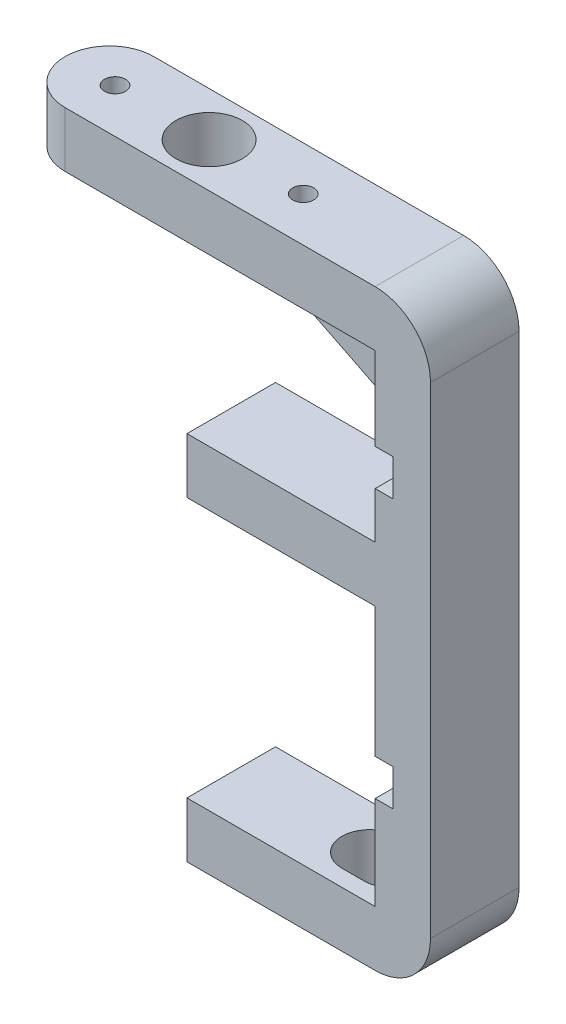
ISO-10303-21;
HEADER;
FILE_DESCRIPTION(('STEP AP214'),'2;1');
FILE_NAME('part.step','',(''),(''),'','','');
FILE_SCHEMA(('AUTOMOTIVE_DESIGN { 1 0 10303 214 1 1 1 1 }'));
ENDSEC;
DATA;
#1=APPLICATION_CONTEXT('core data for automotive mechanical design processes');
#2=APPLICATION_PROTOCOL_DEFINITION('international standard','automotive_design',2000,#1);
#3=PRODUCT_CONTEXT('',#1,'mechanical');
#4=PRODUCT('Part','Part','',(#3));
#5=PRODUCT_RELATED_PRODUCT_CATEGORY('part','',(#4));
#6=PRODUCT_DEFINITION_FORMATION('','',#4);
#7=PRODUCT_DEFINITION_CONTEXT('part definition',#1,'design');
#8=PRODUCT_DEFINITION('design','',#6,#7);
#9=PRODUCT_DEFINITION_SHAPE('','',#8);
#10=(LENGTH_UNIT() NAMED_UNIT(*) SI_UNIT(.MILLI.,.METRE.));
#11=(NAMED_UNIT(*) PLANE_ANGLE_UNIT() SI_UNIT($,.RADIAN.));
#12=(NAMED_UNIT(*) SI_UNIT($,.STERADIAN.) SOLID_ANGLE_UNIT());
#13=UNCERTAINTY_MEASURE_WITH_UNIT(LENGTH_MEASURE(1.E-05),#10,'distance_accuracy_value','');
#14=(GEOMETRIC_REPRESENTATION_CONTEXT(3) GLOBAL_UNCERTAINTY_ASSIGNED_CONTEXT((#13)) GLOBAL_UNIT_ASSIGNED_CONTEXT((#10,
#11,#12)) REPRESENTATION_CONTEXT('',''));
#15=CARTESIAN_POINT('',(0.,0.,0.));
#16=DIRECTION('',(0.,0.,1.));
#17=DIRECTION('',(1.,0.,0.));
#18=AXIS2_PLACEMENT_3D('',#15,#16,#17);
#19=CARTESIAN_POINT('',(17.,0.,4.));
#20=DIRECTION('',(1.,0.,0.));
#21=DIRECTION('',(0.,0.,-1.));
#22=AXIS2_PLACEMENT_3D('',#19,#20,#21);
#23=PLANE('',#22);
#24=DIRECTION('',(0.,-1.,0.));
#25=VECTOR('',#24,1.);
#26=CARTESIAN_POINT('',(17.,0.,-4.));
#27=LINE('',#26,#25);
#28=CARTESIAN_POINT('',(17.,23.5,-4.));
#29=VERTEX_POINT('',#28);
#30=CARTESIAN_POINT('',(17.,11.75,-4.));
#31=VERTEX_POINT('',#30);
#32=EDGE_CURVE('E561',#29,#31,#27,.T.);
#33=ORIENTED_EDGE('',*,*,#32,.T.);
#34=DIRECTION('',(0.,0.,1.));
#35=VECTOR('',#34,1.);
#36=CARTESIAN_POINT('',(17.,11.75,-6.));
#37=LINE('',#36,#35);
#38=CARTESIAN_POINT('',(17.,11.75,4.));
#39=VERTEX_POINT('',#38);
#40=EDGE_CURVE('E335',#31,#39,#37,.T.);
#41=ORIENTED_EDGE('',*,*,#40,.T.);
#42=DIRECTION('',(0.,-1.,0.));
#43=VECTOR('',#42,1.);
#44=CARTESIAN_POINT('',(17.,0.,4.));
#45=LINE('',#44,#43);
#46=CARTESIAN_POINT('',(17.,23.5,4.));
#47=VERTEX_POINT('',#46);
#48=EDGE_CURVE('E269',#47,#39,#45,.T.);
#49=ORIENTED_EDGE('',*,*,#48,.F.);
#50=DIRECTION('',(0.,0.,-1.));
#51=VECTOR('',#50,1.);
#52=CARTESIAN_POINT('',(17.,23.5,4.));
#53=LINE('',#52,#51);
#54=EDGE_CURVE('E324',#47,#29,#53,.T.);
#55=ORIENTED_EDGE('',*,*,#54,.T.);
#56=EDGE_LOOP('',(#33,#41,#49,#55));
#57=FACE_BOUND('',#56,.T.);
#58=ADVANCED_FACE('F37',(#57),#23,.F.);
#59=CARTESIAN_POINT('',(17.,48.5,-4.));
#60=DIRECTION('',(1.,0.,0.));
#61=DIRECTION('',(0.,1.,0.));
#62=AXIS2_PLACEMENT_3D('',#59,#60,#61);
#63=PLANE('',#62);
#64=DIRECTION('',(0.,-1.,0.));
#65=VECTOR('',#64,1.);
#66=CARTESIAN_POINT('',(17.,48.5,-4.));
#67=LINE('',#66,#65);
#68=CARTESIAN_POINT('',(17.,43.5,-4.));
#69=VERTEX_POINT('',#68);
#70=CARTESIAN_POINT('',(17.,36.,-4.));
#71=VERTEX_POINT('',#70);
#72=EDGE_CURVE('E283',#69,#71,#67,.T.);
#73=ORIENTED_EDGE('',*,*,#72,.T.);
#74=DIRECTION('',(0.,0.,1.));
#75=VECTOR('',#74,1.);
#76=CARTESIAN_POINT('',(17.,36.,-6.));
#77=LINE('',#76,#75);
#78=CARTESIAN_POINT('',(17.,36.,4.));
#79=VERTEX_POINT('',#78);
#80=EDGE_CURVE('E352',#71,#79,#77,.T.);
#81=ORIENTED_EDGE('',*,*,#80,.T.);
#82=DIRECTION('',(0.,-1.,0.));
#83=VECTOR('',#82,1.);
#84=CARTESIAN_POINT('',(17.,48.5,4.));
#85=LINE('',#84,#83);
#86=CARTESIAN_POINT('',(17.,43.5,4.));
#87=VERTEX_POINT('',#86);
#88=EDGE_CURVE('E513',#87,#79,#85,.T.);
#89=ORIENTED_EDGE('',*,*,#88,.F.);
#90=DIRECTION('',(0.,0.,1.));
#91=VECTOR('',#90,1.);
#92=CARTESIAN_POINT('',(17.,43.5,4.));
#93=LINE('',#92,#91);
#94=CARTESIAN_POINT('',(17.,43.5,2.5));
#95=VERTEX_POINT('',#94);
#96=EDGE_CURVE('E443',#95,#87,#93,.T.);
#97=ORIENTED_EDGE('',*,*,#96,.F.);
#98=DIRECTION('',(0.,1.,0.));
#99=VECTOR('',#98,1.);
#100=CARTESIAN_POINT('',(17.,38.5,2.5));
#101=LINE('',#100,#99);
#102=CARTESIAN_POINT('',(17.,38.5,2.5));
#103=VERTEX_POINT('',#102);
#104=EDGE_CURVE('E419',#103,#95,#101,.T.);
#105=ORIENTED_EDGE('',*,*,#104,.F.);
#106=DIRECTION('',(0.,0.,-1.));
#107=VECTOR('',#106,1.);
#108=CARTESIAN_POINT('',(17.,38.5,2.5));
#109=LINE('',#108,#107);
#110=CARTESIAN_POINT('',(17.,38.5,-2.5));
#111=VERTEX_POINT('',#110);
#112=EDGE_CURVE('E429',#103,#111,#109,.T.);
#113=ORIENTED_EDGE('',*,*,#112,.T.);
#114=DIRECTION('',(0.,1.,0.));
#115=VECTOR('',#114,1.);
#116=CARTESIAN_POINT('',(17.,38.5,-2.5));
#117=LINE('',#116,#115);
#118=CARTESIAN_POINT('',(17.,43.5,-2.5));
#119=VERTEX_POINT('',#118);
#120=EDGE_CURVE('E430',#111,#119,#117,.T.);
#121=ORIENTED_EDGE('',*,*,#120,.T.);
#122=EDGE_CURVE('E444',#69,#119,#93,.T.);
#123=ORIENTED_EDGE('',*,*,#122,.F.);
#124=EDGE_LOOP('',(#73,#81,#89,#97,#105,#113,#121,#123));
#125=FACE_BOUND('',#124,.T.);
#126=ADVANCED_FACE('F592',(#125),#63,.F.);
#127=CARTESIAN_POINT('',(17.,32.7,4.));
#128=VERTEX_POINT('',#127);
#129=CARTESIAN_POINT('',(17.,28.5,4.));
#130=VERTEX_POINT('',#129);
#131=EDGE_CURVE('E454',#128,#130,#85,.T.);
#132=ORIENTED_EDGE('',*,*,#131,.F.);
#133=DIRECTION('',(0.,0.,1.));
#134=VECTOR('',#133,1.);
#135=CARTESIAN_POINT('',(17.,32.7,-6.));
#136=LINE('',#135,#134);
#137=CARTESIAN_POINT('',(17.,32.7,-4.));
#138=VERTEX_POINT('',#137);
#139=EDGE_CURVE('E351',#138,#128,#136,.T.);
#140=ORIENTED_EDGE('',*,*,#139,.F.);
#141=CARTESIAN_POINT('',(17.,28.5,-4.));
#142=VERTEX_POINT('',#141);
#143=EDGE_CURVE('E510',#138,#142,#67,.T.);
#144=ORIENTED_EDGE('',*,*,#143,.T.);
#145=DIRECTION('',(0.,0.,1.));
#146=VECTOR('',#145,1.);
#147=CARTESIAN_POINT('',(17.,28.5,-4.));
#148=LINE('',#147,#146);
#149=EDGE_CURVE('E303',#142,#130,#148,.T.);
#150=ORIENTED_EDGE('',*,*,#149,.T.);
#151=EDGE_LOOP('',(#132,#140,#144,#150));
#152=FACE_BOUND('',#151,.T.);
#153=ADVANCED_FACE('F597',(#152),#63,.F.);
#154=CARTESIAN_POINT('',(0.,28.5,4.));
#155=DIRECTION('',(0.,-1.,0.));
#156=DIRECTION('',(0.,0.,-1.));
#157=AXIS2_PLACEMENT_3D('',#154,#155,#156);
#158=PLANE('',#157);
#159=ORIENTED_EDGE('',*,*,#149,.F.);
#160=DIRECTION('',(-1.,0.,0.));
#161=VECTOR('',#160,1.);
#162=CARTESIAN_POINT('',(0.,28.5,-4.));
#163=LINE('',#162,#161);
#164=CARTESIAN_POINT('',(0.,28.5,-4.));
#165=VERTEX_POINT('',#164);
#166=EDGE_CURVE('E289',#142,#165,#163,.T.);
#167=ORIENTED_EDGE('',*,*,#166,.T.);
#168=DIRECTION('',(0.,0.,-1.));
#169=VECTOR('',#168,1.);
#170=CARTESIAN_POINT('',(0.,28.5,4.));
#171=LINE('',#170,#169);
#172=CARTESIAN_POINT('',(0.,28.5,4.));
#173=VERTEX_POINT('',#172);
#174=EDGE_CURVE('E323',#173,#165,#171,.T.);
#175=ORIENTED_EDGE('',*,*,#174,.F.);
#176=DIRECTION('',(-1.,0.,0.));
#177=VECTOR('',#176,1.);
#178=CARTESIAN_POINT('',(0.,28.5,4.));
#179=LINE('',#178,#177);
#180=EDGE_CURVE('E299',#130,#173,#179,.T.);
#181=ORIENTED_EDGE('',*,*,#180,.F.);
#182=EDGE_LOOP('',(#159,#167,#175,#181));
#183=FACE_BOUND('',#182,.T.);
#184=ADVANCED_FACE('F614',(#183),#158,.F.);
#185=CARTESIAN_POINT('',(0.,-5.,4.));
#186=DIRECTION('',(1.,0.,0.));
#187=DIRECTION('',(0.,0.,-1.));
#188=AXIS2_PLACEMENT_3D('',#185,#186,#187);
#189=PLANE('',#188);
#190=CARTESIAN_POINT('',(0.,-1.89378755196279,-5.85583143929343E-05));
#191=DIRECTION('',(-1.,0.,0.));
#192=DIRECTION('',(0.,0.,1.));
#193=AXIS2_PLACEMENT_3D('',#190,#191,#192);
#194=CIRCLE('',#193,1.2);
#195=CARTESIAN_POINT('',(0.,-1.89378755196279,1.19994144168561));
#196=VERTEX_POINT('',#195);
#197=EDGE_CURVE('E406',#196,#196,#194,.T.);
#198=ORIENTED_EDGE('',*,*,#197,.F.);
#199=EDGE_LOOP('',(#198));
#200=FACE_BOUND('',#199,.T.);
#201=DIRECTION('',(0.,-1.,0.));
#202=VECTOR('',#201,1.);
#203=CARTESIAN_POINT('',(0.,-5.,-4.));
#204=LINE('',#203,#202);
#205=CARTESIAN_POINT('',(0.,0.,-4.));
#206=VERTEX_POINT('',#205);
#207=CARTESIAN_POINT('',(0.,-5.,-4.));
#208=VERTEX_POINT('',#207);
#209=EDGE_CURVE('E279',#206,#208,#204,.T.);
#210=ORIENTED_EDGE('',*,*,#209,.T.);
#211=DIRECTION('',(0.,0.,-1.));
#212=VECTOR('',#211,1.);
#213=CARTESIAN_POINT('',(0.,-5.,4.));
#214=LINE('',#213,#212);
#215=CARTESIAN_POINT('',(0.,-5.,4.));
#216=VERTEX_POINT('',#215);
#217=EDGE_CURVE('E297',#216,#208,#214,.T.);
#218=ORIENTED_EDGE('',*,*,#217,.F.);
#219=DIRECTION('',(0.,-1.,0.));
#220=VECTOR('',#219,1.);
#221=CARTESIAN_POINT('',(0.,-5.,4.));
#222=LINE('',#221,#220);
#223=CARTESIAN_POINT('',(0.,0.,4.));
#224=VERTEX_POINT('',#223);
#225=EDGE_CURVE('E457',#224,#216,#222,.T.);
#226=ORIENTED_EDGE('',*,*,#225,.F.);
#227=DIRECTION('',(0.,0.,-1.));
#228=VECTOR('',#227,1.);
#229=CARTESIAN_POINT('',(0.,0.,4.));
#230=LINE('',#229,#228);
#231=EDGE_CURVE('E278',#224,#206,#230,.T.);
#232=ORIENTED_EDGE('',*,*,#231,.T.);
#233=EDGE_LOOP('',(#210,#218,#226,#232));
#234=FACE_BOUND('',#233,.T.);
#235=ADVANCED_FACE('F547',(#200,#234),#189,.F.);
#236=CARTESIAN_POINT('',(22.,-5.,4.));
#237=DIRECTION('',(0.,1.,0.));
#238=DIRECTION('',(-1.,0.,0.));
#239=AXIS2_PLACEMENT_3D('',#236,#237,#238);
#240=PLANE('',#239);
#241=CARTESIAN_POINT('',(14.5,-5.,0.));
#242=DIRECTION('',(0.,1.,0.));
#243=DIRECTION('',(-1.,0.,0.));
#244=AXIS2_PLACEMENT_3D('',#241,#242,#243);
#245=CIRCLE('',#244,2.5);
#246=CARTESIAN_POINT('',(17.,-5.,0.));
#247=VERTEX_POINT('',#246);
#248=CARTESIAN_POINT('',(14.5,-5.,-2.5));
#249=VERTEX_POINT('',#248);
#250=EDGE_CURVE('E373',#247,#249,#245,.T.);
#251=ORIENTED_EDGE('',*,*,#250,.T.);
#252=DIRECTION('',(-1.,0.,0.));
#253=VECTOR('',#252,1.);
#254=CARTESIAN_POINT('',(22.,-5.,-2.5));
#255=LINE('',#254,#253);
#256=CARTESIAN_POINT('',(12.5,-5.,-2.5));
#257=VERTEX_POINT('',#256);
#258=EDGE_CURVE('E386',#249,#257,#255,.T.);
#259=ORIENTED_EDGE('',*,*,#258,.T.);
#260=CARTESIAN_POINT('',(12.5,-5.,0.));
#261=DIRECTION('',(0.,1.,0.));
#262=DIRECTION('',(-1.,0.,0.));
#263=AXIS2_PLACEMENT_3D('',#260,#261,#262);
#264=CIRCLE('',#263,2.5);
#265=CARTESIAN_POINT('',(12.5,-5.,2.5));
#266=VERTEX_POINT('',#265);
#267=EDGE_CURVE('E389',#257,#266,#264,.T.);
#268=ORIENTED_EDGE('',*,*,#267,.T.);
#269=DIRECTION('',(1.,0.,0.));
#270=VECTOR('',#269,1.);
#271=CARTESIAN_POINT('',(22.,-5.,2.5));
#272=LINE('',#271,#270);
#273=CARTESIAN_POINT('',(14.5,-5.,2.5));
#274=VERTEX_POINT('',#273);
#275=EDGE_CURVE('E383',#266,#274,#272,.T.);
#276=ORIENTED_EDGE('',*,*,#275,.T.);
#277=EDGE_CURVE('E382',#274,#247,#245,.T.);
#278=ORIENTED_EDGE('',*,*,#277,.T.);
#279=DIRECTION('',(0.,0.,-1.));
#280=VECTOR('',#279,1.);
#281=CARTESIAN_POINT('',(17.,-5.,4.));
#282=LINE('',#281,#280);
#283=CARTESIAN_POINT('',(17.,-5.,4.));
#284=VERTEX_POINT('',#283);
#285=EDGE_CURVE('E484',#247,#284,#282,.F.);
#286=ORIENTED_EDGE('',*,*,#285,.T.);
#287=DIRECTION('',(1.,0.,0.));
#288=VECTOR('',#287,1.);
#289=CARTESIAN_POINT('',(22.,-5.,4.));
#290=LINE('',#289,#288);
#291=EDGE_CURVE('E459',#216,#284,#290,.T.);
#292=ORIENTED_EDGE('',*,*,#291,.F.);
#293=ORIENTED_EDGE('',*,*,#217,.T.);
#294=DIRECTION('',(1.,0.,0.));
#295=VECTOR('',#294,1.);
#296=CARTESIAN_POINT('',(22.,-5.,-4.));
#297=LINE('',#296,#295);
#298=CARTESIAN_POINT('',(17.,-5.,-4.));
#299=VERTEX_POINT('',#298);
#300=EDGE_CURVE('E282',#208,#299,#297,.T.);
#301=ORIENTED_EDGE('',*,*,#300,.T.);
#302=EDGE_CURVE('E480',#299,#247,#282,.F.);
#303=ORIENTED_EDGE('',*,*,#302,.T.);
#304=EDGE_LOOP('',(#251,#259,#268,#276,#278,#286,#292,#293,#301,#303));
#305=FACE_BOUND('',#304,.T.);
#306=ADVANCED_FACE('F534',(#305),#240,.F.);
#307=CARTESIAN_POINT('',(22.,28.5,4.));
#308=DIRECTION('',(-1.,0.,0.));
#309=DIRECTION('',(0.,-1.,0.));
#310=AXIS2_PLACEMENT_3D('',#307,#308,#309);
#311=PLANE('',#310);
#312=DIRECTION('',(0.,1.,0.));
#313=VECTOR('',#312,1.);
#314=CARTESIAN_POINT('',(22.,28.5,4.));
#315=LINE('',#314,#313);
#316=CARTESIAN_POINT('',(22.,0.,4.));
#317=VERTEX_POINT('',#316);
#318=CARTESIAN_POINT('',(22.,43.5,4.));
#319=VERTEX_POINT('',#318);
#320=EDGE_CURVE('E302',#317,#319,#315,.T.);
#321=ORIENTED_EDGE('',*,*,#320,.F.);
#322=DIRECTION('',(0.,0.,-1.));
#323=VECTOR('',#322,1.);
#324=CARTESIAN_POINT('',(22.,0.,4.));
#325=LINE('',#324,#323);
#326=CARTESIAN_POINT('',(22.,0.,-4.));
#327=VERTEX_POINT('',#326);
#328=EDGE_CURVE('E525',#317,#327,#325,.T.);
#329=ORIENTED_EDGE('',*,*,#328,.T.);
#330=DIRECTION('',(0.,1.,0.));
#331=VECTOR('',#330,1.);
#332=CARTESIAN_POINT('',(22.,28.5,-4.));
#333=LINE('',#332,#331);
#334=CARTESIAN_POINT('',(22.,43.5,-4.));
#335=VERTEX_POINT('',#334);
#336=EDGE_CURVE('E286',#327,#335,#333,.T.);
#337=ORIENTED_EDGE('',*,*,#336,.T.);
#338=DIRECTION('',(0.,0.,-1.));
#339=VECTOR('',#338,1.);
#340=CARTESIAN_POINT('',(22.,43.5,4.));
#341=LINE('',#340,#339);
#342=EDGE_CURVE('E477',#335,#319,#341,.F.);
#343=ORIENTED_EDGE('',*,*,#342,.T.);
#344=EDGE_LOOP('',(#321,#329,#337,#343));
#345=FACE_BOUND('',#344,.T.);
#346=ADVANCED_FACE('F610',(#345),#311,.F.);
#347=CARTESIAN_POINT('',(0.,23.5,4.));
#348=DIRECTION('',(1.,0.,0.));
#349=DIRECTION('',(0.,0.,-1.));
#350=AXIS2_PLACEMENT_3D('',#347,#348,#349);
#351=PLANE('',#350);
#352=CARTESIAN_POINT('',(0.,25.0936865803843,-6.14151502839416E-05));
#353=DIRECTION('',(-1.,0.,0.));
#354=DIRECTION('',(0.,0.,1.));
#355=AXIS2_PLACEMENT_3D('',#352,#353,#354);
#356=CIRCLE('',#355,1.2);
#357=CARTESIAN_POINT('',(0.,25.0936865803843,1.19993858484972));
#358=VERTEX_POINT('',#357);
#359=EDGE_CURVE('E405',#358,#358,#356,.T.);
#360=ORIENTED_EDGE('',*,*,#359,.F.);
#361=EDGE_LOOP('',(#360));
#362=FACE_BOUND('',#361,.T.);
#363=DIRECTION('',(0.,-1.,0.));
#364=VECTOR('',#363,1.);
#365=CARTESIAN_POINT('',(0.,23.5,-4.));
#366=LINE('',#365,#364);
#367=CARTESIAN_POINT('',(0.,23.5,-4.));
#368=VERTEX_POINT('',#367);
#369=EDGE_CURVE('E292',#165,#368,#366,.T.);
#370=ORIENTED_EDGE('',*,*,#369,.T.);
#371=DIRECTION('',(0.,0.,-1.));
#372=VECTOR('',#371,1.);
#373=CARTESIAN_POINT('',(0.,23.5,4.));
#374=LINE('',#373,#372);
#375=CARTESIAN_POINT('',(0.,23.5,4.));
#376=VERTEX_POINT('',#375);
#377=EDGE_CURVE('E318',#376,#368,#374,.T.);
#378=ORIENTED_EDGE('',*,*,#377,.F.);
#379=DIRECTION('',(0.,-1.,0.));
#380=VECTOR('',#379,1.);
#381=CARTESIAN_POINT('',(0.,23.5,4.));
#382=LINE('',#381,#380);
#383=EDGE_CURVE('E273',#173,#376,#382,.T.);
#384=ORIENTED_EDGE('',*,*,#383,.F.);
#385=ORIENTED_EDGE('',*,*,#174,.T.);
#386=EDGE_LOOP('',(#370,#378,#384,#385));
#387=FACE_BOUND('',#386,.T.);
#388=ADVANCED_FACE('F319',(#362,#387),#351,.F.);
#389=CARTESIAN_POINT('',(17.,23.5,4.));
#390=DIRECTION('',(0.,1.,0.));
#391=DIRECTION('',(-1.,0.,0.));
#392=AXIS2_PLACEMENT_3D('',#389,#390,#391);
#393=PLANE('',#392);
#394=DIRECTION('',(1.,0.,0.));
#395=VECTOR('',#394,1.);
#396=CARTESIAN_POINT('',(17.,23.5,-4.));
#397=LINE('',#396,#395);
#398=EDGE_CURVE('E329',#368,#29,#397,.T.);
#399=ORIENTED_EDGE('',*,*,#398,.T.);
#400=ORIENTED_EDGE('',*,*,#54,.F.);
#401=DIRECTION('',(1.,0.,0.));
#402=VECTOR('',#401,1.);
#403=CARTESIAN_POINT('',(17.,23.5,4.));
#404=LINE('',#403,#402);
#405=EDGE_CURVE('E270',#376,#47,#404,.T.);
#406=ORIENTED_EDGE('',*,*,#405,.F.);
#407=ORIENTED_EDGE('',*,*,#377,.T.);
#408=EDGE_LOOP('',(#399,#400,#406,#407));
#409=FACE_BOUND('',#408,.T.);
#410=ADVANCED_FACE('F326',(#409),#393,.F.);
#411=CARTESIAN_POINT('',(17.,8.45,4.));
#412=VERTEX_POINT('',#411);
#413=CARTESIAN_POINT('',(17.,0.,4.));
#414=VERTEX_POINT('',#413);
#415=EDGE_CURVE('E258',#412,#414,#45,.T.);
#416=ORIENTED_EDGE('',*,*,#415,.F.);
#417=DIRECTION('',(0.,0.,1.));
#418=VECTOR('',#417,1.);
#419=CARTESIAN_POINT('',(17.,8.45,-6.));
#420=LINE('',#419,#418);
#421=CARTESIAN_POINT('',(17.,8.45,-4.));
#422=VERTEX_POINT('',#421);
#423=EDGE_CURVE('E243',#422,#412,#420,.T.);
#424=ORIENTED_EDGE('',*,*,#423,.F.);
#425=CARTESIAN_POINT('',(17.,0.,-4.));
#426=VERTEX_POINT('',#425);
#427=EDGE_CURVE('E560',#422,#426,#27,.T.);
#428=ORIENTED_EDGE('',*,*,#427,.T.);
#429=DIRECTION('',(0.,0.,-1.));
#430=VECTOR('',#429,1.);
#431=CARTESIAN_POINT('',(17.,0.,4.));
#432=LINE('',#431,#430);
#433=CARTESIAN_POINT('',(17.,0.,0.));
#434=VERTEX_POINT('',#433);
#435=EDGE_CURVE('E551',#434,#426,#432,.T.);
#436=ORIENTED_EDGE('',*,*,#435,.F.);
#437=EDGE_CURVE('E267',#414,#434,#432,.T.);
#438=ORIENTED_EDGE('',*,*,#437,.F.);
#439=EDGE_LOOP('',(#416,#424,#428,#436,#438));
#440=FACE_BOUND('',#439,.T.);
#441=ADVANCED_FACE('F264',(#440),#23,.F.);
#442=CARTESIAN_POINT('',(0.,0.,4.));
#443=DIRECTION('',(0.,-1.,0.));
#444=DIRECTION('',(0.,0.,-1.));
#445=AXIS2_PLACEMENT_3D('',#442,#443,#444);
#446=PLANE('',#445);
#447=DIRECTION('',(1.,0.,0.));
#448=VECTOR('',#447,1.);
#449=CARTESIAN_POINT('',(12.5,0.,2.5));
#450=LINE('',#449,#448);
#451=CARTESIAN_POINT('',(12.5,0.,2.5));
#452=VERTEX_POINT('',#451);
#453=CARTESIAN_POINT('',(14.5,0.,2.5));
#454=VERTEX_POINT('',#453);
#455=EDGE_CURVE('E361',#452,#454,#450,.T.);
#456=ORIENTED_EDGE('',*,*,#455,.F.);
#457=CARTESIAN_POINT('',(12.5,0.,0.));
#458=DIRECTION('',(0.,1.,0.));
#459=DIRECTION('',(0.,0.,1.));
#460=AXIS2_PLACEMENT_3D('',#457,#458,#459);
#461=CIRCLE('',#460,2.5);
#462=CARTESIAN_POINT('',(12.5,0.,-2.5));
#463=VERTEX_POINT('',#462);
#464=EDGE_CURVE('E355',#463,#452,#461,.T.);
#465=ORIENTED_EDGE('',*,*,#464,.F.);
#466=DIRECTION('',(-1.,0.,0.));
#467=VECTOR('',#466,1.);
#468=CARTESIAN_POINT('',(12.5,0.,-2.5));
#469=LINE('',#468,#467);
#470=CARTESIAN_POINT('',(14.5,0.,-2.5));
#471=VERTEX_POINT('',#470);
#472=EDGE_CURVE('E367',#471,#463,#469,.T.);
#473=ORIENTED_EDGE('',*,*,#472,.F.);
#474=CARTESIAN_POINT('',(14.5,0.,0.));
#475=DIRECTION('',(0.,1.,0.));
#476=DIRECTION('',(0.,0.,1.));
#477=AXIS2_PLACEMENT_3D('',#474,#475,#476);
#478=CIRCLE('',#477,2.5);
#479=EDGE_CURVE('E364',#434,#471,#478,.T.);
#480=ORIENTED_EDGE('',*,*,#479,.F.);
#481=ORIENTED_EDGE('',*,*,#435,.T.);
#482=DIRECTION('',(-1.,0.,0.));
#483=VECTOR('',#482,1.);
#484=CARTESIAN_POINT('',(0.,0.,-4.));
#485=LINE('',#484,#483);
#486=EDGE_CURVE('E460',#426,#206,#485,.T.);
#487=ORIENTED_EDGE('',*,*,#486,.T.);
#488=ORIENTED_EDGE('',*,*,#231,.F.);
#489=DIRECTION('',(-1.,0.,0.));
#490=VECTOR('',#489,1.);
#491=CARTESIAN_POINT('',(0.,0.,4.));
#492=LINE('',#491,#490);
#493=EDGE_CURVE('E272',#414,#224,#492,.T.);
#494=ORIENTED_EDGE('',*,*,#493,.F.);
#495=ORIENTED_EDGE('',*,*,#437,.T.);
#496=EDGE_CURVE('E365',#454,#434,#478,.T.);
#497=ORIENTED_EDGE('',*,*,#496,.F.);
#498=EDGE_LOOP('',(#456,#465,#473,#480,#481,#487,#488,#494,#495,#497));
#499=FACE_BOUND('',#498,.T.);
#500=ADVANCED_FACE('F563',(#499),#446,.F.);
#501=CARTESIAN_POINT('',(0.,0.,4.));
#502=DIRECTION('',(0.,0.,-1.));
#503=DIRECTION('',(-1.,0.,0.));
#504=AXIS2_PLACEMENT_3D('',#501,#502,#503);
#505=PLANE('',#504);
#506=ORIENTED_EDGE('',*,*,#48,.T.);
#507=DIRECTION('',(-1.,0.,0.));
#508=VECTOR('',#507,1.);
#509=CARTESIAN_POINT('',(17.,11.75,4.));
#510=LINE('',#509,#508);
#511=CARTESIAN_POINT('',(18.6,11.75,4.));
#512=VERTEX_POINT('',#511);
#513=EDGE_CURVE('E253',#512,#39,#510,.T.);
#514=ORIENTED_EDGE('',*,*,#513,.F.);
#515=DIRECTION('',(0.,1.,0.));
#516=VECTOR('',#515,1.);
#517=CARTESIAN_POINT('',(18.6,11.75,4.));
#518=LINE('',#517,#516);
#519=CARTESIAN_POINT('',(18.6,8.45,4.));
#520=VERTEX_POINT('',#519);
#521=EDGE_CURVE('E262',#520,#512,#518,.T.);
#522=ORIENTED_EDGE('',*,*,#521,.F.);
#523=DIRECTION('',(1.,0.,0.));
#524=VECTOR('',#523,1.);
#525=CARTESIAN_POINT('',(17.,8.45,4.));
#526=LINE('',#525,#524);
#527=EDGE_CURVE('E246',#412,#520,#526,.T.);
#528=ORIENTED_EDGE('',*,*,#527,.F.);
#529=ORIENTED_EDGE('',*,*,#415,.T.);
#530=ORIENTED_EDGE('',*,*,#493,.T.);
#531=ORIENTED_EDGE('',*,*,#225,.T.);
#532=ORIENTED_EDGE('',*,*,#291,.T.);
#533=CARTESIAN_POINT('',(17.,0.,4.));
#534=DIRECTION('',(0.,0.,-1.));
#535=DIRECTION('',(-1.,0.,0.));
#536=AXIS2_PLACEMENT_3D('',#533,#534,#535);
#537=CIRCLE('',#536,5.);
#538=EDGE_CURVE('E470',#284,#317,#537,.F.);
#539=ORIENTED_EDGE('',*,*,#538,.T.);
#540=ORIENTED_EDGE('',*,*,#320,.T.);
#541=CARTESIAN_POINT('',(17.,43.5,4.));
#542=DIRECTION('',(0.,0.,-1.));
#543=DIRECTION('',(-1.,0.,0.));
#544=AXIS2_PLACEMENT_3D('',#541,#542,#543);
#545=CIRCLE('',#544,5.);
#546=CARTESIAN_POINT('',(17.,48.5,4.));
#547=VERTEX_POINT('',#546);
#548=EDGE_CURVE('E468',#319,#547,#545,.F.);
#549=ORIENTED_EDGE('',*,*,#548,.T.);
#550=DIRECTION('',(1.,0.,0.));
#551=VECTOR('',#550,1.);
#552=CARTESIAN_POINT('',(22.,48.5,4.));
#553=LINE('',#552,#551);
#554=CARTESIAN_POINT('',(-11.,48.5,4.));
#555=VERTEX_POINT('',#554);
#556=EDGE_CURVE('E453',#555,#547,#553,.T.);
#557=ORIENTED_EDGE('',*,*,#556,.F.);
#558=DIRECTION('',(0.,1.,0.));
#559=VECTOR('',#558,1.);
#560=CARTESIAN_POINT('',(-11.,0.,4.));
#561=LINE('',#560,#559);
#562=CARTESIAN_POINT('',(-11.,43.5,4.));
#563=VERTEX_POINT('',#562);
#564=EDGE_CURVE('E500',#555,#563,#561,.F.);
#565=ORIENTED_EDGE('',*,*,#564,.T.);
#566=DIRECTION('',(1.,0.,0.));
#567=VECTOR('',#566,1.);
#568=CARTESIAN_POINT('',(-15.,43.5,4.));
#569=LINE('',#568,#567);
#570=EDGE_CURVE('E446',#563,#87,#569,.T.);
#571=ORIENTED_EDGE('',*,*,#570,.T.);
#572=ORIENTED_EDGE('',*,*,#88,.T.);
#573=DIRECTION('',(-1.,0.,0.));
#574=VECTOR('',#573,1.);
#575=CARTESIAN_POINT('',(17.,36.,4.));
#576=LINE('',#575,#574);
#577=CARTESIAN_POINT('',(18.6,36.,4.));
#578=VERTEX_POINT('',#577);
#579=EDGE_CURVE('E349',#578,#79,#576,.T.);
#580=ORIENTED_EDGE('',*,*,#579,.F.);
#581=DIRECTION('',(0.,1.,0.));
#582=VECTOR('',#581,1.);
#583=CARTESIAN_POINT('',(18.6,36.,4.));
#584=LINE('',#583,#582);
#585=CARTESIAN_POINT('',(18.6,32.7,4.));
#586=VERTEX_POINT('',#585);
#587=EDGE_CURVE('E346',#586,#578,#584,.T.);
#588=ORIENTED_EDGE('',*,*,#587,.F.);
#589=DIRECTION('',(1.,0.,0.));
#590=VECTOR('',#589,1.);
#591=CARTESIAN_POINT('',(17.,32.7,4.));
#592=LINE('',#591,#590);
#593=EDGE_CURVE('E341',#128,#586,#592,.T.);
#594=ORIENTED_EDGE('',*,*,#593,.F.);
#595=ORIENTED_EDGE('',*,*,#131,.T.);
#596=ORIENTED_EDGE('',*,*,#180,.T.);
#597=ORIENTED_EDGE('',*,*,#383,.T.);
#598=ORIENTED_EDGE('',*,*,#405,.T.);
#599=EDGE_LOOP('',(#506,#514,#522,#528,#529,#530,#531,#532,#539,#540,#549,#557,#565,#571,#572,
#580,#588,#594,#595,#596,#597,#598));
#600=FACE_BOUND('',#599,.T.);
#601=ADVANCED_FACE('F257',(#600),#505,.F.);
#602=CARTESIAN_POINT('',(0.,0.,-4.));
#603=DIRECTION('',(0.,0.,-1.));
#604=DIRECTION('',(-1.,0.,0.));
#605=AXIS2_PLACEMENT_3D('',#602,#603,#604);
#606=PLANE('',#605);
#607=DIRECTION('',(1.,0.,0.));
#608=VECTOR('',#607,1.);
#609=CARTESIAN_POINT('',(0.,11.75,-4.));
#610=LINE('',#609,#608);
#611=CARTESIAN_POINT('',(18.6,11.75,-4.));
#612=VERTEX_POINT('',#611);
#613=EDGE_CURVE('E11',#31,#612,#610,.T.);
#614=ORIENTED_EDGE('',*,*,#613,.F.);
#615=ORIENTED_EDGE('',*,*,#32,.F.);
#616=ORIENTED_EDGE('',*,*,#398,.F.);
#617=ORIENTED_EDGE('',*,*,#369,.F.);
#618=ORIENTED_EDGE('',*,*,#166,.F.);
#619=ORIENTED_EDGE('',*,*,#143,.F.);
#620=DIRECTION('',(-1.,0.,0.));
#621=VECTOR('',#620,1.);
#622=CARTESIAN_POINT('',(0.,32.7,-4.));
#623=LINE('',#622,#621);
#624=CARTESIAN_POINT('',(18.6,32.7,-4.));
#625=VERTEX_POINT('',#624);
#626=EDGE_CURVE('E509',#625,#138,#623,.T.);
#627=ORIENTED_EDGE('',*,*,#626,.F.);
#628=DIRECTION('',(0.,-1.,0.));
#629=VECTOR('',#628,1.);
#630=CARTESIAN_POINT('',(18.6,0.,-4.));
#631=LINE('',#630,#629);
#632=CARTESIAN_POINT('',(18.6,36.,-4.));
#633=VERTEX_POINT('',#632);
#634=EDGE_CURVE('E695',#633,#625,#631,.T.);
#635=ORIENTED_EDGE('',*,*,#634,.F.);
#636=DIRECTION('',(1.,0.,0.));
#637=VECTOR('',#636,1.);
#638=CARTESIAN_POINT('',(0.,36.,-4.));
#639=LINE('',#638,#637);
#640=EDGE_CURVE('E667',#71,#633,#639,.T.);
#641=ORIENTED_EDGE('',*,*,#640,.F.);
#642=ORIENTED_EDGE('',*,*,#72,.F.);
#643=DIRECTION('',(1.,0.,0.));
#644=VECTOR('',#643,1.);
#645=CARTESIAN_POINT('',(-15.,43.5,-4.));
#646=LINE('',#645,#644);
#647=CARTESIAN_POINT('',(-11.,43.5,-4.));
#648=VERTEX_POINT('',#647);
#649=EDGE_CURVE('E448',#648,#69,#646,.T.);
#650=ORIENTED_EDGE('',*,*,#649,.F.);
#651=DIRECTION('',(0.,-1.,0.));
#652=VECTOR('',#651,1.);
#653=CARTESIAN_POINT('',(-11.,48.5,-4.));
#654=LINE('',#653,#652);
#655=CARTESIAN_POINT('',(-11.,48.5,-3.99999999999999));
#656=VERTEX_POINT('',#655);
#657=EDGE_CURVE('E493',#648,#656,#654,.F.);
#658=ORIENTED_EDGE('',*,*,#657,.T.);
#659=DIRECTION('',(-1.,0.,0.));
#660=VECTOR('',#659,1.);
#661=CARTESIAN_POINT('',(22.,48.5,-4.));
#662=LINE('',#661,#660);
#663=CARTESIAN_POINT('',(17.,48.5,-4.));
#664=VERTEX_POINT('',#663);
#665=EDGE_CURVE('E450',#664,#656,#662,.T.);
#666=ORIENTED_EDGE('',*,*,#665,.F.);
#667=CARTESIAN_POINT('',(17.,43.5,-4.));
#668=DIRECTION('',(0.,0.,-1.));
#669=DIRECTION('',(-1.,0.,0.));
#670=AXIS2_PLACEMENT_3D('',#667,#668,#669);
#671=CIRCLE('',#670,5.);
#672=EDGE_CURVE('E527',#664,#335,#671,.T.);
#673=ORIENTED_EDGE('',*,*,#672,.T.);
#674=ORIENTED_EDGE('',*,*,#336,.F.);
#675=CARTESIAN_POINT('',(17.,0.,-4.));
#676=DIRECTION('',(0.,0.,-1.));
#677=DIRECTION('',(-1.,0.,0.));
#678=AXIS2_PLACEMENT_3D('',#675,#676,#677);
#679=CIRCLE('',#678,5.);
#680=EDGE_CURVE('E528',#327,#299,#679,.T.);
#681=ORIENTED_EDGE('',*,*,#680,.T.);
#682=ORIENTED_EDGE('',*,*,#300,.F.);
#683=ORIENTED_EDGE('',*,*,#209,.F.);
#684=ORIENTED_EDGE('',*,*,#486,.F.);
#685=ORIENTED_EDGE('',*,*,#427,.F.);
#686=DIRECTION('',(-1.,0.,0.));
#687=VECTOR('',#686,1.);
#688=CARTESIAN_POINT('',(0.,8.45,-4.));
#689=LINE('',#688,#687);
#690=CARTESIAN_POINT('',(18.6,8.45,-4.));
#691=VERTEX_POINT('',#690);
#692=EDGE_CURVE('E249',#691,#422,#689,.T.);
#693=ORIENTED_EDGE('',*,*,#692,.F.);
#694=DIRECTION('',(0.,-1.,0.));
#695=VECTOR('',#694,1.);
#696=CARTESIAN_POINT('',(18.6,0.,-4.));
#697=LINE('',#696,#695);
#698=EDGE_CURVE('E45',#612,#691,#697,.T.);
#699=ORIENTED_EDGE('',*,*,#698,.F.);
#700=EDGE_LOOP('',(#614,#615,#616,#617,#618,#619,#627,#635,#641,#642,#650,#658,#666,#673,#674,
#681,#682,#683,#684,#685,#693,#699));
#701=FACE_BOUND('',#700,.T.);
#702=ADVANCED_FACE('F543',(#701),#606,.T.);
#703=CARTESIAN_POINT('',(0.,48.5,0.));
#704=DIRECTION('',(0.,-1.,0.));
#705=DIRECTION('',(0.,0.,-1.));
#706=AXIS2_PLACEMENT_3D('',#703,#704,#705);
#707=PLANE('',#706);
#708=CARTESIAN_POINT('',(6.49999999999999,48.5,0.));
#709=DIRECTION('',(0.,1.,0.));
#710=DIRECTION('',(0.,0.,1.));
#711=AXIS2_PLACEMENT_3D('',#708,#709,#710);
#712=CIRCLE('',#711,0.95);
#713=CARTESIAN_POINT('',(6.49999999999999,48.5,0.95));
#714=VERTEX_POINT('',#713);
#715=EDGE_CURVE('E392',#714,#714,#712,.T.);
#716=ORIENTED_EDGE('',*,*,#715,.F.);
#717=EDGE_LOOP('',(#716));
#718=FACE_BOUND('',#717,.T.);
#719=CARTESIAN_POINT('',(-10.5,48.5,0.));
#720=DIRECTION('',(0.,1.,0.));
#721=DIRECTION('',(0.,0.,1.));
#722=AXIS2_PLACEMENT_3D('',#719,#720,#721);
#723=CIRCLE('',#722,0.949999999999999);
#724=CARTESIAN_POINT('',(-10.5,48.5,0.950000000000001));
#725=VERTEX_POINT('',#724);
#726=EDGE_CURVE('E398',#725,#725,#723,.T.);
#727=ORIENTED_EDGE('',*,*,#726,.F.);
#728=EDGE_LOOP('',(#727));
#729=FACE_BOUND('',#728,.T.);
#730=CARTESIAN_POINT('',(-2.00000000000001,48.5,0.));
#731=DIRECTION('',(0.,1.,0.));
#732=DIRECTION('',(0.,0.,1.));
#733=AXIS2_PLACEMENT_3D('',#730,#731,#732);
#734=CIRCLE('',#733,3.);
#735=CARTESIAN_POINT('',(-2.00000000000001,48.5,3.));
#736=VERTEX_POINT('',#735);
#737=EDGE_CURVE('E413',#736,#736,#734,.T.);
#738=ORIENTED_EDGE('',*,*,#737,.F.);
#739=EDGE_LOOP('',(#738));
#740=FACE_BOUND('',#739,.T.);
#741=ORIENTED_EDGE('',*,*,#665,.T.);
#742=CARTESIAN_POINT('',(-11.,48.5,0.));
#743=DIRECTION('',(0.,-1.,0.));
#744=DIRECTION('',(0.,0.,-1.));
#745=AXIS2_PLACEMENT_3D('',#742,#743,#744);
#746=CIRCLE('',#745,4.);
#747=CARTESIAN_POINT('',(-15.,48.5,0.));
#748=VERTEX_POINT('',#747);
#749=EDGE_CURVE('E498',#656,#748,#746,.F.);
#750=ORIENTED_EDGE('',*,*,#749,.T.);
#751=CARTESIAN_POINT('',(-11.,48.5,0.));
#752=DIRECTION('',(0.,-1.,0.));
#753=DIRECTION('',(0.,0.,-1.));
#754=AXIS2_PLACEMENT_3D('',#751,#752,#753);
#755=CIRCLE('',#754,4.);
#756=EDGE_CURVE('E496',#748,#555,#755,.F.);
#757=ORIENTED_EDGE('',*,*,#756,.T.);
#758=ORIENTED_EDGE('',*,*,#556,.T.);
#759=DIRECTION('',(0.,0.,-1.));
#760=VECTOR('',#759,1.);
#761=CARTESIAN_POINT('',(17.,48.5,0.));
#762=LINE('',#761,#760);
#763=EDGE_CURVE('E479',#547,#664,#762,.T.);
#764=ORIENTED_EDGE('',*,*,#763,.T.);
#765=EDGE_LOOP('',(#741,#750,#757,#758,#764));
#766=FACE_BOUND('',#765,.T.);
#767=ADVANCED_FACE('F649',(#718,#729,#740,#766),#707,.F.);
#768=CARTESIAN_POINT('',(-15.,43.5,4.));
#769=DIRECTION('',(0.,1.,0.));
#770=DIRECTION('',(-1.,0.,0.));
#771=AXIS2_PLACEMENT_3D('',#768,#769,#770);
#772=PLANE('',#771);
#773=CARTESIAN_POINT('',(-10.5,43.5,0.));
#774=DIRECTION('',(0.,1.,0.));
#775=DIRECTION('',(-1.,0.,0.));
#776=AXIS2_PLACEMENT_3D('',#773,#774,#775);
#777=CIRCLE('',#776,0.949999999999999);
#778=CARTESIAN_POINT('',(-11.45,43.5,0.));
#779=VERTEX_POINT('',#778);
#780=EDGE_CURVE('E401',#779,#779,#777,.T.);
#781=ORIENTED_EDGE('',*,*,#780,.T.);
#782=EDGE_LOOP('',(#781));
#783=FACE_BOUND('',#782,.T.);
#784=CARTESIAN_POINT('',(-2.00000000000001,43.5,0.));
#785=DIRECTION('',(0.,1.,0.));
#786=DIRECTION('',(-1.,0.,0.));
#787=AXIS2_PLACEMENT_3D('',#784,#785,#786);
#788=CIRCLE('',#787,3.);
#789=CARTESIAN_POINT('',(-5.00000000000001,43.5,0.));
#790=VERTEX_POINT('',#789);
#791=EDGE_CURVE('E418',#790,#790,#788,.T.);
#792=ORIENTED_EDGE('',*,*,#791,.T.);
#793=EDGE_LOOP('',(#792));
#794=FACE_BOUND('',#793,.T.);
#795=DIRECTION('',(0.,0.,-1.));
#796=VECTOR('',#795,1.);
#797=CARTESIAN_POINT('',(6.99999999999999,43.5,2.5));
#798=LINE('',#797,#796);
#799=CARTESIAN_POINT('',(6.99999999999999,43.5,-0.807774721070176));
#800=VERTEX_POINT('',#799);
#801=CARTESIAN_POINT('',(7.,43.5,-2.5));
#802=VERTEX_POINT('',#801);
#803=EDGE_CURVE('E439',#800,#802,#798,.T.);
#804=ORIENTED_EDGE('',*,*,#803,.F.);
#805=CARTESIAN_POINT('',(6.49999999999999,43.5,0.));
#806=DIRECTION('',(0.,1.,0.));
#807=DIRECTION('',(-1.,0.,0.));
#808=AXIS2_PLACEMENT_3D('',#805,#806,#807);
#809=CIRCLE('',#808,0.95);
#810=CARTESIAN_POINT('',(6.99999999999999,43.5,0.807774721070175));
#811=VERTEX_POINT('',#810);
#812=EDGE_CURVE('E395',#800,#811,#809,.T.);
#813=ORIENTED_EDGE('',*,*,#812,.T.);
#814=CARTESIAN_POINT('',(7.00000000000002,43.5,2.5));
#815=VERTEX_POINT('',#814);
#816=EDGE_CURVE('E440',#815,#811,#798,.T.);
#817=ORIENTED_EDGE('',*,*,#816,.F.);
#818=DIRECTION('',(-1.,0.,0.));
#819=VECTOR('',#818,1.);
#820=CARTESIAN_POINT('',(17.,43.5,2.5));
#821=LINE('',#820,#819);
#822=EDGE_CURVE('E422',#95,#815,#821,.T.);
#823=ORIENTED_EDGE('',*,*,#822,.F.);
#824=ORIENTED_EDGE('',*,*,#96,.T.);
#825=ORIENTED_EDGE('',*,*,#570,.F.);
#826=CARTESIAN_POINT('',(-11.,43.5,0.));
#827=DIRECTION('',(0.,1.,0.));
#828=DIRECTION('',(-1.,0.,0.));
#829=AXIS2_PLACEMENT_3D('',#826,#827,#828);
#830=CIRCLE('',#829,4.);
#831=CARTESIAN_POINT('',(-15.,43.5,0.));
#832=VERTEX_POINT('',#831);
#833=EDGE_CURVE('E489',#563,#832,#830,.F.);
#834=ORIENTED_EDGE('',*,*,#833,.T.);
#835=CARTESIAN_POINT('',(-11.,43.5,0.));
#836=DIRECTION('',(0.,1.,0.));
#837=DIRECTION('',(-1.,0.,0.));
#838=AXIS2_PLACEMENT_3D('',#835,#836,#837);
#839=CIRCLE('',#838,4.);
#840=EDGE_CURVE('E491',#832,#648,#839,.F.);
#841=ORIENTED_EDGE('',*,*,#840,.T.);
#842=ORIENTED_EDGE('',*,*,#649,.T.);
#843=ORIENTED_EDGE('',*,*,#122,.T.);
#844=DIRECTION('',(-1.,0.,0.));
#845=VECTOR('',#844,1.);
#846=CARTESIAN_POINT('',(17.,43.5,-2.5));
#847=LINE('',#846,#845);
#848=EDGE_CURVE('E433',#119,#802,#847,.T.);
#849=ORIENTED_EDGE('',*,*,#848,.T.);
#850=EDGE_LOOP('',(#804,#813,#817,#823,#824,#825,#834,#841,#842,#843,#849));
#851=FACE_BOUND('',#850,.T.);
#852=ADVANCED_FACE('F655',(#783,#794,#851),#772,.F.);
#853=CARTESIAN_POINT('',(6.99999999999999,43.5,2.5));
#854=DIRECTION('',(0.447213595499959,0.894427190999916,0.));
#855=DIRECTION('',(-0.894427190999915,0.447213595499959,0.));
#856=AXIS2_PLACEMENT_3D('',#853,#854,#855);
#857=PLANE('',#856);
#858=ORIENTED_EDGE('',*,*,#816,.T.);
#859=CARTESIAN_POINT('',(6.49999999999999,43.75,0.));
#860=DIRECTION('',(0.447213595499959,0.894427190999916,0.));
#861=DIRECTION('',(-0.894427190999915,0.447213595499959,0.));
#862=AXIS2_PLACEMENT_3D('',#859,#860,#861);
#863=ELLIPSE('',#862,1.0621322893124,0.95);
#864=EDGE_CURVE('E502',#811,#800,#863,.T.);
#865=ORIENTED_EDGE('',*,*,#864,.T.);
#866=ORIENTED_EDGE('',*,*,#803,.T.);
#867=DIRECTION('',(0.894427190999916,-0.447213595499959,0.));
#868=VECTOR('',#867,1.);
#869=CARTESIAN_POINT('',(6.99999999999999,43.5,-2.5));
#870=LINE('',#869,#868);
#871=EDGE_CURVE('E423',#802,#111,#870,.T.);
#872=ORIENTED_EDGE('',*,*,#871,.T.);
#873=ORIENTED_EDGE('',*,*,#112,.F.);
#874=DIRECTION('',(0.894427190999916,-0.447213595499959,0.));
#875=VECTOR('',#874,1.);
#876=CARTESIAN_POINT('',(6.99999999999999,43.5,2.5));
#877=LINE('',#876,#875);
#878=EDGE_CURVE('E426',#815,#103,#877,.T.);
#879=ORIENTED_EDGE('',*,*,#878,.F.);
#880=EDGE_LOOP('',(#858,#865,#866,#872,#873,#879));
#881=FACE_BOUND('',#880,.T.);
#882=ADVANCED_FACE('F718',(#881),#857,.F.);
#883=CARTESIAN_POINT('',(0.,0.,2.5));
#884=DIRECTION('',(0.,0.,1.));
#885=DIRECTION('',(1.,0.,0.));
#886=AXIS2_PLACEMENT_3D('',#883,#884,#885);
#887=PLANE('',#886);
#888=ORIENTED_EDGE('',*,*,#104,.T.);
#889=ORIENTED_EDGE('',*,*,#822,.T.);
#890=ORIENTED_EDGE('',*,*,#878,.T.);
#891=EDGE_LOOP('',(#888,#889,#890));
#892=FACE_BOUND('',#891,.T.);
#893=ADVANCED_FACE('F735',(#892),#887,.T.);
#894=CARTESIAN_POINT('',(0.,0.,-2.5));
#895=DIRECTION('',(0.,0.,1.));
#896=DIRECTION('',(1.,0.,0.));
#897=AXIS2_PLACEMENT_3D('',#894,#895,#896);
#898=PLANE('',#897);
#899=ORIENTED_EDGE('',*,*,#120,.F.);
#900=ORIENTED_EDGE('',*,*,#871,.F.);
#901=ORIENTED_EDGE('',*,*,#848,.F.);
#902=EDGE_LOOP('',(#899,#900,#901));
#903=FACE_BOUND('',#902,.T.);
#904=ADVANCED_FACE('F728',(#903),#898,.F.);
#905=CARTESIAN_POINT('',(-2.00000000000001,33.5,0.));
#906=DIRECTION('',(0.,1.,0.));
#907=DIRECTION('',(0.,0.,1.));
#908=AXIS2_PLACEMENT_3D('',#905,#906,#907);
#909=CYLINDRICAL_SURFACE('',#908,3.);
#910=ORIENTED_EDGE('',*,*,#737,.T.);
#911=EDGE_LOOP('',(#910));
#912=FACE_BOUND('',#911,.T.);
#913=ORIENTED_EDGE('',*,*,#791,.F.);
#914=EDGE_LOOP('',(#913));
#915=FACE_BOUND('',#914,.T.);
#916=ADVANCED_FACE('F626',(#912,#915),#909,.F.);
#917=CARTESIAN_POINT('',(17.,0.,4.));
#918=DIRECTION('',(0.,0.,-1.));
#919=DIRECTION('',(-1.,0.,0.));
#920=AXIS2_PLACEMENT_3D('',#917,#918,#919);
#921=CYLINDRICAL_SURFACE('',#920,5.);
#922=ORIENTED_EDGE('',*,*,#538,.F.);
#923=ORIENTED_EDGE('',*,*,#285,.F.);
#924=ORIENTED_EDGE('',*,*,#302,.F.);
#925=ORIENTED_EDGE('',*,*,#680,.F.);
#926=ORIENTED_EDGE('',*,*,#328,.F.);
#927=EDGE_LOOP('',(#922,#923,#924,#925,#926));
#928=FACE_BOUND('',#927,.T.);
#929=ADVANCED_FACE('F539',(#928),#921,.T.);
#930=CARTESIAN_POINT('',(17.,43.5,0.));
#931=DIRECTION('',(0.,0.,-1.));
#932=DIRECTION('',(-1.,0.,0.));
#933=AXIS2_PLACEMENT_3D('',#930,#931,#932);
#934=CYLINDRICAL_SURFACE('',#933,5.);
#935=ORIENTED_EDGE('',*,*,#548,.F.);
#936=ORIENTED_EDGE('',*,*,#342,.F.);
#937=ORIENTED_EDGE('',*,*,#672,.F.);
#938=ORIENTED_EDGE('',*,*,#763,.F.);
#939=EDGE_LOOP('',(#935,#936,#937,#938));
#940=FACE_BOUND('',#939,.T.);
#941=ADVANCED_FACE('F476',(#940),#934,.T.);
#942=CARTESIAN_POINT('',(8.,25.0936865803843,-6.14151502839416E-05));
#943=DIRECTION('',(-1.,0.,0.));
#944=DIRECTION('',(0.,0.,1.));
#945=AXIS2_PLACEMENT_3D('',#942,#943,#944);
#946=CYLINDRICAL_SURFACE('',#945,1.2);
#947=CARTESIAN_POINT('',(8.,25.0936865803843,-6.14151502839416E-05));
#948=DIRECTION('',(-1.,0.,0.));
#949=DIRECTION('',(0.,0.,1.));
#950=AXIS2_PLACEMENT_3D('',#947,#948,#949);
#951=CIRCLE('',#950,1.2);
#952=CARTESIAN_POINT('',(8.,25.0936865803843,1.19993858484972));
#953=VERTEX_POINT('',#952);
#954=EDGE_CURVE('E410',#953,#953,#951,.T.);
#955=ORIENTED_EDGE('',*,*,#954,.F.);
#956=EDGE_LOOP('',(#955));
#957=FACE_BOUND('',#956,.T.);
#958=ORIENTED_EDGE('',*,*,#359,.T.);
#959=EDGE_LOOP('',(#958));
#960=FACE_BOUND('',#959,.T.);
#961=ADVANCED_FACE('F628',(#957,#960),#946,.F.);
#962=CARTESIAN_POINT('',(8.,25.0936865803843,-6.14151502839416E-05));
#963=DIRECTION('',(-1.,0.,0.));
#964=DIRECTION('',(0.,0.,1.));
#965=AXIS2_PLACEMENT_3D('',#962,#963,#964);
#966=PLANE('',#965);
#967=ORIENTED_EDGE('',*,*,#954,.T.);
#968=EDGE_LOOP('',(#967));
#969=FACE_BOUND('',#968,.T.);
#970=ADVANCED_FACE('F766',(#969),#966,.T.);
#971=CARTESIAN_POINT('',(8.,-1.89378755196279,-5.85583143929343E-05));
#972=DIRECTION('',(-1.,0.,0.));
#973=DIRECTION('',(0.,0.,1.));
#974=AXIS2_PLACEMENT_3D('',#971,#972,#973);
#975=CYLINDRICAL_SURFACE('',#974,1.2);
#976=CARTESIAN_POINT('',(8.,-1.89378755196279,-5.85583143929343E-05));
#977=DIRECTION('',(-1.,0.,0.));
#978=DIRECTION('',(0.,0.,1.));
#979=AXIS2_PLACEMENT_3D('',#976,#977,#978);
#980=CIRCLE('',#979,1.2);
#981=CARTESIAN_POINT('',(8.,-1.89378755196279,1.19994144168561));
#982=VERTEX_POINT('',#981);
#983=EDGE_CURVE('E402',#982,#982,#980,.T.);
#984=ORIENTED_EDGE('',*,*,#983,.F.);
#985=EDGE_LOOP('',(#984));
#986=FACE_BOUND('',#985,.T.);
#987=ORIENTED_EDGE('',*,*,#197,.T.);
#988=EDGE_LOOP('',(#987));
#989=FACE_BOUND('',#988,.T.);
#990=ADVANCED_FACE('F763',(#986,#989),#975,.F.);
#991=CARTESIAN_POINT('',(8.,-1.89378755196279,-5.85583143929343E-05));
#992=DIRECTION('',(-1.,0.,0.));
#993=DIRECTION('',(0.,0.,1.));
#994=AXIS2_PLACEMENT_3D('',#991,#992,#993);
#995=PLANE('',#994);
#996=ORIENTED_EDGE('',*,*,#983,.T.);
#997=EDGE_LOOP('',(#996));
#998=FACE_BOUND('',#997,.T.);
#999=ADVANCED_FACE('F639',(#998),#995,.T.);
#1000=CARTESIAN_POINT('',(-11.,0.,0.));
#1001=DIRECTION('',(0.,1.,0.));
#1002=DIRECTION('',(0.,0.,1.));
#1003=AXIS2_PLACEMENT_3D('',#1000,#1001,#1002);
#1004=CYLINDRICAL_SURFACE('',#1003,4.);
#1005=ORIENTED_EDGE('',*,*,#564,.F.);
#1006=ORIENTED_EDGE('',*,*,#756,.F.);
#1007=DIRECTION('',(0.,1.,0.));
#1008=VECTOR('',#1007,1.);
#1009=CARTESIAN_POINT('',(-15.,0.,0.));
#1010=LINE('',#1009,#1008);
#1011=EDGE_CURVE('E409',#832,#748,#1010,.T.);
#1012=ORIENTED_EDGE('',*,*,#1011,.F.);
#1013=ORIENTED_EDGE('',*,*,#833,.F.);
#1014=EDGE_LOOP('',(#1005,#1006,#1012,#1013));
#1015=FACE_BOUND('',#1014,.T.);
#1016=ADVANCED_FACE('F39',(#1015),#1004,.T.);
#1017=CARTESIAN_POINT('',(-11.,0.,0.));
#1018=DIRECTION('',(0.,1.,0.));
#1019=DIRECTION('',(0.,0.,1.));
#1020=AXIS2_PLACEMENT_3D('',#1017,#1018,#1019);
#1021=CYLINDRICAL_SURFACE('',#1020,4.);
#1022=ORIENTED_EDGE('',*,*,#749,.F.);
#1023=ORIENTED_EDGE('',*,*,#657,.F.);
#1024=ORIENTED_EDGE('',*,*,#840,.F.);
#1025=ORIENTED_EDGE('',*,*,#1011,.T.);
#1026=EDGE_LOOP('',(#1022,#1023,#1024,#1025));
#1027=FACE_BOUND('',#1026,.T.);
#1028=ADVANCED_FACE('F629',(#1027),#1021,.T.);
#1029=CARTESIAN_POINT('',(-10.5,35.5,0.));
#1030=DIRECTION('',(0.,1.,0.));
#1031=DIRECTION('',(0.,0.,1.));
#1032=AXIS2_PLACEMENT_3D('',#1029,#1030,#1031);
#1033=CYLINDRICAL_SURFACE('',#1032,0.949999999999999);
#1034=ORIENTED_EDGE('',*,*,#726,.T.);
#1035=EDGE_LOOP('',(#1034));
#1036=FACE_BOUND('',#1035,.T.);
#1037=ORIENTED_EDGE('',*,*,#780,.F.);
#1038=EDGE_LOOP('',(#1037));
#1039=FACE_BOUND('',#1038,.T.);
#1040=ADVANCED_FACE('F631',(#1036,#1039),#1033,.F.);
#1041=CARTESIAN_POINT('',(6.49999999999999,35.5,0.));
#1042=DIRECTION('',(0.,1.,0.));
#1043=DIRECTION('',(0.,0.,1.));
#1044=AXIS2_PLACEMENT_3D('',#1041,#1042,#1043);
#1045=CYLINDRICAL_SURFACE('',#1044,0.95);
#1046=ORIENTED_EDGE('',*,*,#715,.T.);
#1047=EDGE_LOOP('',(#1046));
#1048=FACE_BOUND('',#1047,.T.);
#1049=ORIENTED_EDGE('',*,*,#864,.F.);
#1050=ORIENTED_EDGE('',*,*,#812,.F.);
#1051=EDGE_LOOP('',(#1049,#1050));
#1052=FACE_BOUND('',#1051,.T.);
#1053=ADVANCED_FACE('F587',(#1048,#1052),#1045,.F.);
#1054=CARTESIAN_POINT('',(12.5,-10.,0.));
#1055=DIRECTION('',(0.,1.,0.));
#1056=DIRECTION('',(0.,0.,1.));
#1057=AXIS2_PLACEMENT_3D('',#1054,#1055,#1056);
#1058=CYLINDRICAL_SURFACE('',#1057,2.5);
#1059=DIRECTION('',(0.,1.,0.));
#1060=VECTOR('',#1059,1.);
#1061=CARTESIAN_POINT('',(12.5,-10.,-2.5));
#1062=LINE('',#1061,#1060);
#1063=EDGE_CURVE('E371',#257,#463,#1062,.T.);
#1064=ORIENTED_EDGE('',*,*,#1063,.T.);
#1065=ORIENTED_EDGE('',*,*,#464,.T.);
#1066=DIRECTION('',(0.,1.,0.));
#1067=VECTOR('',#1066,1.);
#1068=CARTESIAN_POINT('',(12.5,-10.,2.5));
#1069=LINE('',#1068,#1067);
#1070=EDGE_CURVE('E370',#266,#452,#1069,.T.);
#1071=ORIENTED_EDGE('',*,*,#1070,.F.);
#1072=ORIENTED_EDGE('',*,*,#267,.F.);
#1073=EDGE_LOOP('',(#1064,#1065,#1071,#1072));
#1074=FACE_BOUND('',#1073,.T.);
#1075=ADVANCED_FACE('F576',(#1074),#1058,.F.);
#1076=CARTESIAN_POINT('',(12.5,-10.,-2.5));
#1077=DIRECTION('',(0.,0.,-1.));
#1078=DIRECTION('',(-1.,0.,0.));
#1079=AXIS2_PLACEMENT_3D('',#1076,#1077,#1078);
#1080=PLANE('',#1079);
#1081=DIRECTION('',(0.,1.,0.));
#1082=VECTOR('',#1081,1.);
#1083=CARTESIAN_POINT('',(14.5,-10.,-2.5));
#1084=LINE('',#1083,#1082);
#1085=EDGE_CURVE('E374',#249,#471,#1084,.T.);
#1086=ORIENTED_EDGE('',*,*,#1085,.T.);
#1087=ORIENTED_EDGE('',*,*,#472,.T.);
#1088=ORIENTED_EDGE('',*,*,#1063,.F.);
#1089=ORIENTED_EDGE('',*,*,#258,.F.);
#1090=EDGE_LOOP('',(#1086,#1087,#1088,#1089));
#1091=FACE_BOUND('',#1090,.T.);
#1092=ADVANCED_FACE('F579',(#1091),#1080,.F.);
#1093=CARTESIAN_POINT('',(12.5,-10.,2.5));
#1094=DIRECTION('',(0.,0.,1.));
#1095=DIRECTION('',(1.,0.,0.));
#1096=AXIS2_PLACEMENT_3D('',#1093,#1094,#1095);
#1097=PLANE('',#1096);
#1098=ORIENTED_EDGE('',*,*,#1070,.T.);
#1099=ORIENTED_EDGE('',*,*,#455,.T.);
#1100=DIRECTION('',(0.,1.,0.));
#1101=VECTOR('',#1100,1.);
#1102=CARTESIAN_POINT('',(14.5,-10.,2.5));
#1103=LINE('',#1102,#1101);
#1104=EDGE_CURVE('E376',#274,#454,#1103,.T.);
#1105=ORIENTED_EDGE('',*,*,#1104,.F.);
#1106=ORIENTED_EDGE('',*,*,#275,.F.);
#1107=EDGE_LOOP('',(#1098,#1099,#1105,#1106));
#1108=FACE_BOUND('',#1107,.T.);
#1109=ADVANCED_FACE('F573',(#1108),#1097,.F.);
#1110=CARTESIAN_POINT('',(14.5,-10.,0.));
#1111=DIRECTION('',(0.,1.,0.));
#1112=DIRECTION('',(0.,0.,1.));
#1113=AXIS2_PLACEMENT_3D('',#1110,#1111,#1112);
#1114=CYLINDRICAL_SURFACE('',#1113,2.5);
#1115=ORIENTED_EDGE('',*,*,#1104,.T.);
#1116=ORIENTED_EDGE('',*,*,#496,.T.);
#1117=ORIENTED_EDGE('',*,*,#479,.T.);
#1118=ORIENTED_EDGE('',*,*,#1085,.F.);
#1119=ORIENTED_EDGE('',*,*,#250,.F.);
#1120=ORIENTED_EDGE('',*,*,#277,.F.);
#1121=EDGE_LOOP('',(#1115,#1116,#1117,#1118,#1119,#1120));
#1122=FACE_BOUND('',#1121,.T.);
#1123=ADVANCED_FACE('F570',(#1122),#1114,.F.);
#1124=CARTESIAN_POINT('',(17.,36.,-6.));
#1125=DIRECTION('',(0.,1.,0.));
#1126=DIRECTION('',(0.,0.,1.));
#1127=AXIS2_PLACEMENT_3D('',#1124,#1125,#1126);
#1128=PLANE('',#1127);
#1129=ORIENTED_EDGE('',*,*,#640,.T.);
#1130=DIRECTION('',(0.,0.,1.));
#1131=VECTOR('',#1130,1.);
#1132=CARTESIAN_POINT('',(18.6,36.,-6.));
#1133=LINE('',#1132,#1131);
#1134=EDGE_CURVE('E356',#633,#578,#1133,.T.);
#1135=ORIENTED_EDGE('',*,*,#1134,.T.);
#1136=ORIENTED_EDGE('',*,*,#579,.T.);
#1137=ORIENTED_EDGE('',*,*,#80,.F.);
#1138=EDGE_LOOP('',(#1129,#1135,#1136,#1137));
#1139=FACE_BOUND('',#1138,.T.);
#1140=ADVANCED_FACE('F685',(#1139),#1128,.F.);
#1141=CARTESIAN_POINT('',(18.6,36.,-6.));
#1142=DIRECTION('',(1.,0.,0.));
#1143=DIRECTION('',(0.,1.,0.));
#1144=AXIS2_PLACEMENT_3D('',#1141,#1142,#1143);
#1145=PLANE('',#1144);
#1146=ORIENTED_EDGE('',*,*,#634,.T.);
#1147=DIRECTION('',(0.,0.,1.));
#1148=VECTOR('',#1147,1.);
#1149=CARTESIAN_POINT('',(18.6,32.7,-6.));
#1150=LINE('',#1149,#1148);
#1151=EDGE_CURVE('E60',#625,#586,#1150,.T.);
#1152=ORIENTED_EDGE('',*,*,#1151,.T.);
#1153=ORIENTED_EDGE('',*,*,#587,.T.);
#1154=ORIENTED_EDGE('',*,*,#1134,.F.);
#1155=EDGE_LOOP('',(#1146,#1152,#1153,#1154));
#1156=FACE_BOUND('',#1155,.T.);
#1157=ADVANCED_FACE('F681',(#1156),#1145,.F.);
#1158=CARTESIAN_POINT('',(17.,32.7,-6.));
#1159=DIRECTION('',(0.,-1.,0.));
#1160=DIRECTION('',(0.,0.,-1.));
#1161=AXIS2_PLACEMENT_3D('',#1158,#1159,#1160);
#1162=PLANE('',#1161);
#1163=ORIENTED_EDGE('',*,*,#626,.T.);
#1164=ORIENTED_EDGE('',*,*,#139,.T.);
#1165=ORIENTED_EDGE('',*,*,#593,.T.);
#1166=ORIENTED_EDGE('',*,*,#1151,.F.);
#1167=EDGE_LOOP('',(#1163,#1164,#1165,#1166));
#1168=FACE_BOUND('',#1167,.T.);
#1169=ADVANCED_FACE('F674',(#1168),#1162,.F.);
#1170=CARTESIAN_POINT('',(17.,11.75,-6.));
#1171=DIRECTION('',(0.,1.,0.));
#1172=DIRECTION('',(0.,0.,1.));
#1173=AXIS2_PLACEMENT_3D('',#1170,#1171,#1172);
#1174=PLANE('',#1173);
#1175=ORIENTED_EDGE('',*,*,#613,.T.);
#1176=DIRECTION('',(0.,0.,1.));
#1177=VECTOR('',#1176,1.);
#1178=CARTESIAN_POINT('',(18.6,11.75,-6.));
#1179=LINE('',#1178,#1177);
#1180=EDGE_CURVE('E342',#612,#512,#1179,.T.);
#1181=ORIENTED_EDGE('',*,*,#1180,.T.);
#1182=ORIENTED_EDGE('',*,*,#513,.T.);
#1183=ORIENTED_EDGE('',*,*,#40,.F.);
#1184=EDGE_LOOP('',(#1175,#1181,#1182,#1183));
#1185=FACE_BOUND('',#1184,.T.);
#1186=ADVANCED_FACE('F672',(#1185),#1174,.F.);
#1187=CARTESIAN_POINT('',(18.6,11.75,-6.));
#1188=DIRECTION('',(1.,0.,0.));
#1189=DIRECTION('',(0.,0.,-1.));
#1190=AXIS2_PLACEMENT_3D('',#1187,#1188,#1189);
#1191=PLANE('',#1190);
#1192=ORIENTED_EDGE('',*,*,#698,.T.);
#1193=DIRECTION('',(0.,0.,1.));
#1194=VECTOR('',#1193,1.);
#1195=CARTESIAN_POINT('',(18.6,8.45,-6.));
#1196=LINE('',#1195,#1194);
#1197=EDGE_CURVE('E52',#691,#520,#1196,.T.);
#1198=ORIENTED_EDGE('',*,*,#1197,.T.);
#1199=ORIENTED_EDGE('',*,*,#521,.T.);
#1200=ORIENTED_EDGE('',*,*,#1180,.F.);
#1201=EDGE_LOOP('',(#1192,#1198,#1199,#1200));
#1202=FACE_BOUND('',#1201,.T.);
#1203=ADVANCED_FACE('F671',(#1202),#1191,.F.);
#1204=CARTESIAN_POINT('',(17.,8.45,-6.));
#1205=DIRECTION('',(0.,-1.,0.));
#1206=DIRECTION('',(0.,0.,-1.));
#1207=AXIS2_PLACEMENT_3D('',#1204,#1205,#1206);
#1208=PLANE('',#1207);
#1209=ORIENTED_EDGE('',*,*,#692,.T.);
#1210=ORIENTED_EDGE('',*,*,#423,.T.);
#1211=ORIENTED_EDGE('',*,*,#527,.T.);
#1212=ORIENTED_EDGE('',*,*,#1197,.F.);
#1213=EDGE_LOOP('',(#1209,#1210,#1211,#1212));
#1214=FACE_BOUND('',#1213,.T.);
#1215=ADVANCED_FACE('F245',(#1214),#1208,.F.);
#1216=CLOSED_SHELL('',(#58,#126,#153,#184,#235,#306,#346,#388,#410,#441,#500,#601,#702,#767,
#852,#882,#893,#904,#916,#929,#941,#961,#970,#990,#999,#1016,#1028,#1040,#1053,#1075,#1092,
#1109,#1123,#1140,#1157,#1169,#1186,#1203,#1215));
#1217=MANIFOLD_SOLID_BREP('B2',#1216);
#1218=ADVANCED_BREP_SHAPE_REPRESENTATION('',(#18,#1217),#14);
#1219=SHAPE_DEFINITION_REPRESENTATION(#9,#1218);
ENDSEC;
END-ISO-10303-21;
